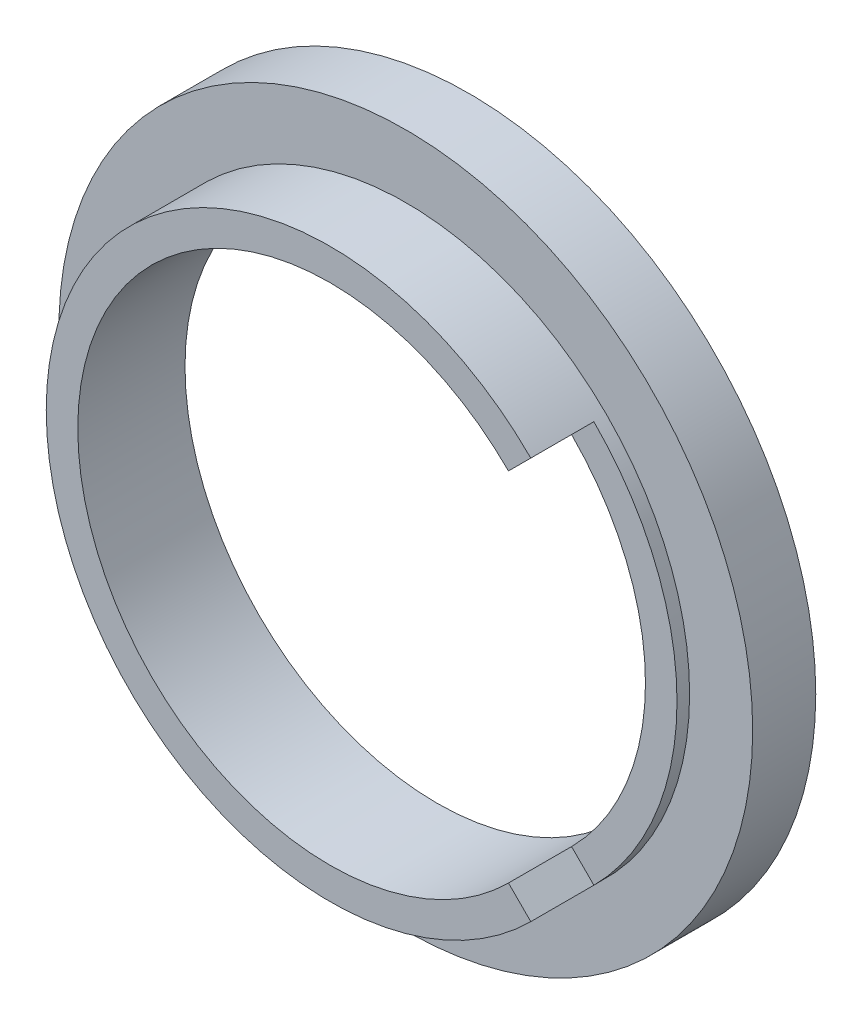
ISO-10303-21;
HEADER;
FILE_DESCRIPTION(('STEP AP214'),'2;1');
FILE_NAME('part.step','',(''),(''),'','','');
FILE_SCHEMA(('AUTOMOTIVE_DESIGN { 1 0 10303 214 1 1 1 1 }'));
ENDSEC;
DATA;
#1=APPLICATION_CONTEXT('core data for automotive mechanical design processes');
#2=APPLICATION_PROTOCOL_DEFINITION('international standard','automotive_design',2000,#1);
#3=PRODUCT_CONTEXT('',#1,'mechanical');
#4=PRODUCT('Part','Part','',(#3));
#5=PRODUCT_RELATED_PRODUCT_CATEGORY('part','',(#4));
#6=PRODUCT_DEFINITION_FORMATION('','',#4);
#7=PRODUCT_DEFINITION_CONTEXT('part definition',#1,'design');
#8=PRODUCT_DEFINITION('design','',#6,#7);
#9=PRODUCT_DEFINITION_SHAPE('','',#8);
#10=(LENGTH_UNIT() NAMED_UNIT(*) SI_UNIT(.MILLI.,.METRE.));
#11=(NAMED_UNIT(*) PLANE_ANGLE_UNIT() SI_UNIT($,.RADIAN.));
#12=(NAMED_UNIT(*) SI_UNIT($,.STERADIAN.) SOLID_ANGLE_UNIT());
#13=UNCERTAINTY_MEASURE_WITH_UNIT(LENGTH_MEASURE(1.E-05),#10,'distance_accuracy_value','');
#14=(GEOMETRIC_REPRESENTATION_CONTEXT(3) GLOBAL_UNCERTAINTY_ASSIGNED_CONTEXT((#13)) GLOBAL_UNIT_ASSIGNED_CONTEXT((#10,
#11,#12)) REPRESENTATION_CONTEXT('',''));
#15=CARTESIAN_POINT('',(0.,0.,0.));
#16=DIRECTION('',(0.,0.,1.));
#17=DIRECTION('',(1.,0.,0.));
#18=AXIS2_PLACEMENT_3D('',#15,#16,#17);
#19=CARTESIAN_POINT('',(0.,0.,4.4));
#20=DIRECTION('',(0.,0.,-1.));
#21=DIRECTION('',(-1.,0.,0.));
#22=AXIS2_PLACEMENT_3D('',#19,#20,#21);
#23=CYLINDRICAL_SURFACE('',#22,9.);
#24=CARTESIAN_POINT('',(0.,0.,2.));
#25=DIRECTION('',(0.,0.,1.));
#26=DIRECTION('',(1.,0.,0.));
#27=AXIS2_PLACEMENT_3D('',#24,#25,#26);
#28=CIRCLE('',#27,9.);
#29=CARTESIAN_POINT('',(9.,0.,2.));
#30=VERTEX_POINT('',#29);
#31=EDGE_CURVE('E125',#30,#30,#28,.T.);
#32=ORIENTED_EDGE('',*,*,#31,.T.);
#33=EDGE_LOOP('',(#32));
#34=FACE_BOUND('',#33,.T.);
#35=DIRECTION('',(0.,0.,1.));
#36=VECTOR('',#35,1.);
#37=CARTESIAN_POINT('',(6.36396103067892,6.36396103067894,2.4));
#38=LINE('',#37,#36);
#39=CARTESIAN_POINT('',(6.36396103067892,6.36396103067894,2.4));
#40=VERTEX_POINT('',#39);
#41=CARTESIAN_POINT('',(6.36396103067892,6.36396103067894,4.4));
#42=VERTEX_POINT('',#41);
#43=EDGE_CURVE('E94',#40,#42,#38,.T.);
#44=ORIENTED_EDGE('',*,*,#43,.F.);
#45=CARTESIAN_POINT('',(0.,0.,2.4));
#46=DIRECTION('',(0.,0.,1.));
#47=DIRECTION('',(1.,0.,0.));
#48=AXIS2_PLACEMENT_3D('',#45,#46,#47);
#49=CIRCLE('',#48,9.);
#50=CARTESIAN_POINT('',(6.36396103067901,-6.36396103067885,2.4));
#51=VERTEX_POINT('',#50);
#52=EDGE_CURVE('E79',#51,#40,#49,.T.);
#53=ORIENTED_EDGE('',*,*,#52,.F.);
#54=DIRECTION('',(0.,0.,1.));
#55=VECTOR('',#54,1.);
#56=CARTESIAN_POINT('',(6.36396103067901,-6.36396103067885,2.4));
#57=LINE('',#56,#55);
#58=CARTESIAN_POINT('',(6.36396103067901,-6.36396103067885,4.4));
#59=VERTEX_POINT('',#58);
#60=EDGE_CURVE('E86',#51,#59,#57,.T.);
#61=ORIENTED_EDGE('',*,*,#60,.T.);
#62=CARTESIAN_POINT('',(0.,0.,4.4));
#63=DIRECTION('',(0.,0.,1.));
#64=DIRECTION('',(1.,0.,0.));
#65=AXIS2_PLACEMENT_3D('',#62,#63,#64);
#66=CIRCLE('',#65,9.);
#67=EDGE_CURVE('E117',#42,#59,#66,.T.);
#68=ORIENTED_EDGE('',*,*,#67,.F.);
#69=EDGE_LOOP('',(#44,#53,#61,#68));
#70=FACE_BOUND('',#69,.T.);
#71=ADVANCED_FACE('F38',(#34,#70),#23,.T.);
#72=CARTESIAN_POINT('',(0.,0.,4.4));
#73=DIRECTION('',(0.,0.,1.));
#74=DIRECTION('',(1.,0.,0.));
#75=AXIS2_PLACEMENT_3D('',#72,#73,#74);
#76=PLANE('',#75);
#77=CARTESIAN_POINT('',(0.,0.,4.4));
#78=DIRECTION('',(0.,0.,1.));
#79=DIRECTION('',(1.,0.,0.));
#80=AXIS2_PLACEMENT_3D('',#77,#78,#79);
#81=CIRCLE('',#80,8.);
#82=CARTESIAN_POINT('',(5.65685424949237,5.65685424949239,4.4));
#83=VERTEX_POINT('',#82);
#84=CARTESIAN_POINT('',(5.65685424949245,-5.65685424949231,4.4));
#85=VERTEX_POINT('',#84);
#86=EDGE_CURVE('E112',#83,#85,#81,.T.);
#87=ORIENTED_EDGE('',*,*,#86,.F.);
#88=DIRECTION('',(0.707106781186546,0.707106781186549,0.));
#89=VECTOR('',#88,1.);
#90=CARTESIAN_POINT('',(0.,0.,4.4));
#91=LINE('',#90,#89);
#92=EDGE_CURVE('E100',#83,#42,#91,.T.);
#93=ORIENTED_EDGE('',*,*,#92,.T.);
#94=ORIENTED_EDGE('',*,*,#67,.T.);
#95=DIRECTION('',(0.707106781186556,-0.707106781186539,0.));
#96=VECTOR('',#95,1.);
#97=CARTESIAN_POINT('',(0.,0.,4.4));
#98=LINE('',#97,#96);
#99=EDGE_CURVE('E89',#85,#59,#98,.T.);
#100=ORIENTED_EDGE('',*,*,#99,.F.);
#101=EDGE_LOOP('',(#87,#93,#94,#100));
#102=FACE_BOUND('',#101,.T.);
#103=ADVANCED_FACE('F146',(#102),#76,.T.);
#104=CARTESIAN_POINT('',(0.,0.,11.));
#105=DIRECTION('',(0.,0.,-1.));
#106=DIRECTION('',(-1.,0.,0.));
#107=AXIS2_PLACEMENT_3D('',#104,#105,#106);
#108=CYLINDRICAL_SURFACE('',#107,8.);
#109=CARTESIAN_POINT('',(0.,0.,1.));
#110=DIRECTION('',(0.,0.,-1.));
#111=DIRECTION('',(-1.,0.,0.));
#112=AXIS2_PLACEMENT_3D('',#109,#110,#111);
#113=CIRCLE('',#112,8.);
#114=CARTESIAN_POINT('',(-8.,0.,1.));
#115=VERTEX_POINT('',#114);
#116=EDGE_CURVE('E107',#115,#115,#113,.T.);
#117=ORIENTED_EDGE('',*,*,#116,.T.);
#118=EDGE_LOOP('',(#117));
#119=FACE_BOUND('',#118,.T.);
#120=DIRECTION('',(0.,0.,-1.));
#121=VECTOR('',#120,1.);
#122=CARTESIAN_POINT('',(5.65685424949237,5.65685424949239,11.));
#123=LINE('',#122,#121);
#124=CARTESIAN_POINT('',(5.65685424949237,5.65685424949239,2.4));
#125=VERTEX_POINT('',#124);
#126=EDGE_CURVE('E11',#83,#125,#123,.T.);
#127=ORIENTED_EDGE('',*,*,#126,.F.);
#128=ORIENTED_EDGE('',*,*,#86,.T.);
#129=DIRECTION('',(0.,0.,-1.));
#130=VECTOR('',#129,1.);
#131=CARTESIAN_POINT('',(5.65685424949245,-5.65685424949231,11.));
#132=LINE('',#131,#130);
#133=CARTESIAN_POINT('',(5.65685424949245,-5.65685424949231,2.4));
#134=VERTEX_POINT('',#133);
#135=EDGE_CURVE('E47',#85,#134,#132,.T.);
#136=ORIENTED_EDGE('',*,*,#135,.T.);
#137=CARTESIAN_POINT('',(0.,0.,2.4));
#138=DIRECTION('',(0.,0.,1.));
#139=DIRECTION('',(1.,0.,0.));
#140=AXIS2_PLACEMENT_3D('',#137,#138,#139);
#141=CIRCLE('',#140,8.);
#142=EDGE_CURVE('E58',#125,#134,#141,.F.);
#143=ORIENTED_EDGE('',*,*,#142,.F.);
#144=EDGE_LOOP('',(#127,#128,#136,#143));
#145=FACE_BOUND('',#144,.T.);
#146=ADVANCED_FACE('F143',(#119,#145),#108,.F.);
#147=CARTESIAN_POINT('',(0.,0.,2.));
#148=DIRECTION('',(0.,0.,-1.));
#149=DIRECTION('',(-1.,0.,0.));
#150=AXIS2_PLACEMENT_3D('',#147,#148,#149);
#151=CYLINDRICAL_SURFACE('',#150,11.);
#152=CARTESIAN_POINT('',(0.,0.,2.));
#153=DIRECTION('',(0.,0.,1.));
#154=DIRECTION('',(1.,0.,0.));
#155=AXIS2_PLACEMENT_3D('',#152,#153,#154);
#156=CIRCLE('',#155,11.);
#157=CARTESIAN_POINT('',(11.,0.,2.));
#158=VERTEX_POINT('',#157);
#159=EDGE_CURVE('E129',#158,#158,#156,.T.);
#160=ORIENTED_EDGE('',*,*,#159,.F.);
#161=EDGE_LOOP('',(#160));
#162=FACE_BOUND('',#161,.T.);
#163=CARTESIAN_POINT('',(0.,0.,0.));
#164=DIRECTION('',(0.,0.,1.));
#165=DIRECTION('',(1.,0.,0.));
#166=AXIS2_PLACEMENT_3D('',#163,#164,#165);
#167=CIRCLE('',#166,11.);
#168=CARTESIAN_POINT('',(11.,0.,0.));
#169=VERTEX_POINT('',#168);
#170=EDGE_CURVE('E124',#169,#169,#167,.T.);
#171=ORIENTED_EDGE('',*,*,#170,.T.);
#172=EDGE_LOOP('',(#171));
#173=FACE_BOUND('',#172,.T.);
#174=ADVANCED_FACE('F40',(#162,#173),#151,.T.);
#175=CARTESIAN_POINT('',(0.,0.,2.));
#176=DIRECTION('',(0.,0.,1.));
#177=DIRECTION('',(1.,0.,0.));
#178=AXIS2_PLACEMENT_3D('',#175,#176,#177);
#179=PLANE('',#178);
#180=ORIENTED_EDGE('',*,*,#31,.F.);
#181=EDGE_LOOP('',(#180));
#182=FACE_BOUND('',#181,.T.);
#183=ORIENTED_EDGE('',*,*,#159,.T.);
#184=EDGE_LOOP('',(#183));
#185=FACE_BOUND('',#184,.T.);
#186=ADVANCED_FACE('F173',(#182,#185),#179,.T.);
#187=CARTESIAN_POINT('',(0.,0.,0.));
#188=DIRECTION('',(0.,0.,1.));
#189=DIRECTION('',(1.,0.,0.));
#190=AXIS2_PLACEMENT_3D('',#187,#188,#189);
#191=PLANE('',#190);
#192=CARTESIAN_POINT('',(0.,0.,0.));
#193=DIRECTION('',(0.,0.,-1.));
#194=DIRECTION('',(-1.,0.,0.));
#195=AXIS2_PLACEMENT_3D('',#192,#193,#194);
#196=CIRCLE('',#195,10.);
#197=CARTESIAN_POINT('',(-10.,0.,0.));
#198=VERTEX_POINT('',#197);
#199=EDGE_CURVE('E118',#198,#198,#196,.T.);
#200=ORIENTED_EDGE('',*,*,#199,.F.);
#201=EDGE_LOOP('',(#200));
#202=FACE_BOUND('',#201,.T.);
#203=ORIENTED_EDGE('',*,*,#170,.F.);
#204=EDGE_LOOP('',(#203));
#205=FACE_BOUND('',#204,.T.);
#206=ADVANCED_FACE('F175',(#202,#205),#191,.F.);
#207=CARTESIAN_POINT('',(0.,0.,1.));
#208=DIRECTION('',(0.,0.,-1.));
#209=DIRECTION('',(-1.,0.,0.));
#210=AXIS2_PLACEMENT_3D('',#207,#208,#209);
#211=CYLINDRICAL_SURFACE('',#210,10.);
#212=CARTESIAN_POINT('',(0.,0.,1.));
#213=DIRECTION('',(0.,0.,-1.));
#214=DIRECTION('',(-1.,0.,0.));
#215=AXIS2_PLACEMENT_3D('',#212,#213,#214);
#216=CIRCLE('',#215,10.);
#217=CARTESIAN_POINT('',(-10.,0.,1.));
#218=VERTEX_POINT('',#217);
#219=EDGE_CURVE('E113',#218,#218,#216,.T.);
#220=ORIENTED_EDGE('',*,*,#219,.F.);
#221=EDGE_LOOP('',(#220));
#222=FACE_BOUND('',#221,.T.);
#223=ORIENTED_EDGE('',*,*,#199,.T.);
#224=EDGE_LOOP('',(#223));
#225=FACE_BOUND('',#224,.T.);
#226=ADVANCED_FACE('F159',(#222,#225),#211,.F.);
#227=CARTESIAN_POINT('',(0.,0.,1.));
#228=DIRECTION('',(0.,0.,-1.));
#229=DIRECTION('',(-1.,0.,0.));
#230=AXIS2_PLACEMENT_3D('',#227,#228,#229);
#231=PLANE('',#230);
#232=ORIENTED_EDGE('',*,*,#116,.F.);
#233=EDGE_LOOP('',(#232));
#234=FACE_BOUND('',#233,.T.);
#235=ORIENTED_EDGE('',*,*,#219,.T.);
#236=EDGE_LOOP('',(#235));
#237=FACE_BOUND('',#236,.T.);
#238=ADVANCED_FACE('F151',(#234,#237),#231,.T.);
#239=CARTESIAN_POINT('',(0.,0.,2.4));
#240=DIRECTION('',(0.707106781186549,-0.707106781186546,0.));
#241=DIRECTION('',(0.707106781186546,0.707106781186549,0.));
#242=AXIS2_PLACEMENT_3D('',#239,#240,#241);
#243=PLANE('',#242);
#244=ORIENTED_EDGE('',*,*,#126,.T.);
#245=DIRECTION('',(0.707106781186546,0.707106781186549,0.));
#246=VECTOR('',#245,1.);
#247=CARTESIAN_POINT('',(0.,0.,2.4));
#248=LINE('',#247,#246);
#249=EDGE_CURVE('E54',#125,#40,#248,.T.);
#250=ORIENTED_EDGE('',*,*,#249,.T.);
#251=ORIENTED_EDGE('',*,*,#43,.T.);
#252=ORIENTED_EDGE('',*,*,#92,.F.);
#253=EDGE_LOOP('',(#244,#250,#251,#252));
#254=FACE_BOUND('',#253,.T.);
#255=ADVANCED_FACE('F148',(#254),#243,.T.);
#256=CARTESIAN_POINT('',(0.,0.,2.4));
#257=DIRECTION('',(-0.707106781186539,-0.707106781186556,0.));
#258=DIRECTION('',(0.707106781186556,-0.707106781186539,0.));
#259=AXIS2_PLACEMENT_3D('',#256,#257,#258);
#260=PLANE('',#259);
#261=ORIENTED_EDGE('',*,*,#99,.T.);
#262=ORIENTED_EDGE('',*,*,#60,.F.);
#263=DIRECTION('',(0.707106781186556,-0.707106781186539,0.));
#264=VECTOR('',#263,1.);
#265=CARTESIAN_POINT('',(0.,0.,2.4));
#266=LINE('',#265,#264);
#267=EDGE_CURVE('E75',#134,#51,#266,.T.);
#268=ORIENTED_EDGE('',*,*,#267,.F.);
#269=ORIENTED_EDGE('',*,*,#135,.F.);
#270=EDGE_LOOP('',(#261,#262,#268,#269));
#271=FACE_BOUND('',#270,.T.);
#272=ADVANCED_FACE('F87',(#271),#260,.F.);
#273=CARTESIAN_POINT('',(0.,0.,2.4));
#274=DIRECTION('',(0.,0.,1.));
#275=DIRECTION('',(1.,0.,0.));
#276=AXIS2_PLACEMENT_3D('',#273,#274,#275);
#277=PLANE('',#276);
#278=ORIENTED_EDGE('',*,*,#142,.T.);
#279=ORIENTED_EDGE('',*,*,#267,.T.);
#280=ORIENTED_EDGE('',*,*,#52,.T.);
#281=ORIENTED_EDGE('',*,*,#249,.F.);
#282=EDGE_LOOP('',(#278,#279,#280,#281));
#283=FACE_BOUND('',#282,.T.);
#284=ADVANCED_FACE('F77',(#283),#277,.T.);
#285=CLOSED_SHELL('',(#71,#103,#146,#174,#186,#206,#226,#238,#255,#272,#284));
#286=MANIFOLD_SOLID_BREP('B2',#285);
#287=ADVANCED_BREP_SHAPE_REPRESENTATION('',(#18,#286),#14);
#288=SHAPE_DEFINITION_REPRESENTATION(#9,#287);
ENDSEC;
END-ISO-10303-21;
